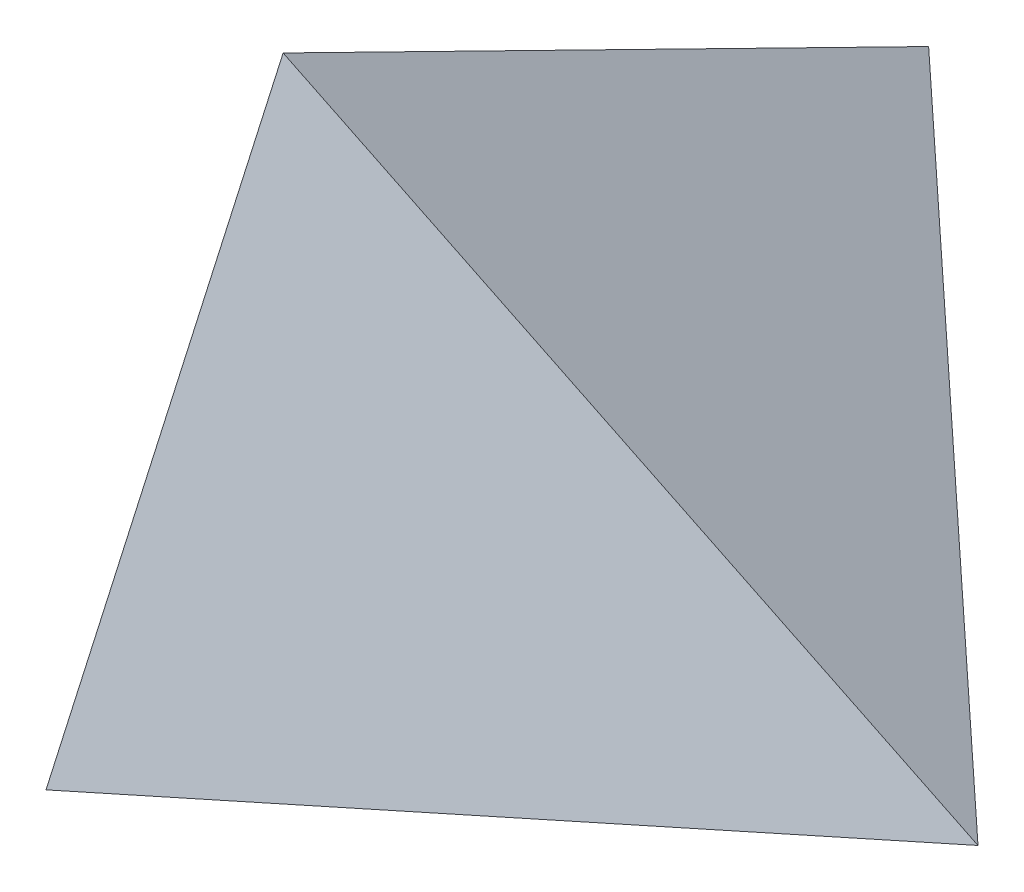
ISO-10303-21;
HEADER;
FILE_DESCRIPTION(('STEP AP214'),'2;1');
FILE_NAME('part.step','',(''),(''),'','','');
FILE_SCHEMA(('AUTOMOTIVE_DESIGN { 1 0 10303 214 1 1 1 1 }'));
ENDSEC;
DATA;
#1=APPLICATION_CONTEXT('core data for automotive mechanical design processes');
#2=APPLICATION_PROTOCOL_DEFINITION('international standard','automotive_design',2000,#1);
#3=PRODUCT_CONTEXT('',#1,'mechanical');
#4=PRODUCT('Part','Part','',(#3));
#5=PRODUCT_RELATED_PRODUCT_CATEGORY('part','',(#4));
#6=PRODUCT_DEFINITION_FORMATION('','',#4);
#7=PRODUCT_DEFINITION_CONTEXT('part definition',#1,'design');
#8=PRODUCT_DEFINITION('design','',#6,#7);
#9=PRODUCT_DEFINITION_SHAPE('','',#8);
#10=(LENGTH_UNIT() NAMED_UNIT(*) SI_UNIT(.MILLI.,.METRE.));
#11=(NAMED_UNIT(*) PLANE_ANGLE_UNIT() SI_UNIT($,.RADIAN.));
#12=(NAMED_UNIT(*) SI_UNIT($,.STERADIAN.) SOLID_ANGLE_UNIT());
#13=UNCERTAINTY_MEASURE_WITH_UNIT(LENGTH_MEASURE(1.E-05),#10,'distance_accuracy_value','');
#14=(GEOMETRIC_REPRESENTATION_CONTEXT(3) GLOBAL_UNCERTAINTY_ASSIGNED_CONTEXT((#13)) GLOBAL_UNIT_ASSIGNED_CONTEXT((#10,
#11,#12)) REPRESENTATION_CONTEXT('',''));
#15=CARTESIAN_POINT('',(0.,0.,0.));
#16=DIRECTION('',(0.,0.,1.));
#17=DIRECTION('',(1.,0.,0.));
#18=AXIS2_PLACEMENT_3D('',#15,#16,#17);
#19=CARTESIAN_POINT('',(0.,5.,0.));
#20=DIRECTION('',(0.389152688830815,-0.868020634220767,-0.308383468011376));
#21=DIRECTION('',(0.912493631813819,0.409090909088953,0.));
#22=AXIS2_PLACEMENT_3D('',#19,#20,#21);
#23=PLANE('',#22);
#24=DIRECTION('',(-0.912493631813819,-0.409090909088953,0.));
#25=VECTOR('',#24,1.);
#26=CARTESIAN_POINT('',(100.3742995,50.,0.));
#27=LINE('',#26,#25);
#28=CARTESIAN_POINT('',(100.3742995,50.,0.));
#29=VERTEX_POINT('',#28);
#30=CARTESIAN_POINT('',(0.,5.,0.));
#31=VERTEX_POINT('',#30);
#32=EDGE_CURVE('E68',#29,#31,#27,.T.);
#33=ORIENTED_EDGE('',*,*,#32,.T.);
#34=DIRECTION('',(0.146673225113615,0.388888888895528,-0.909534164904416));
#35=VECTOR('',#34,1.);
#36=CARTESIAN_POINT('',(0.,5.,0.));
#37=LINE('',#36,#35);
#38=CARTESIAN_POINT('',(13.20059026,40.,-81.85807484));
#39=VERTEX_POINT('',#38);
#40=EDGE_CURVE('E43',#31,#39,#37,.T.);
#41=ORIENTED_EDGE('',*,*,#40,.T.);
#42=DIRECTION('',(0.726447577020908,0.0833333333357317,0.6821506236863));
#43=VECTOR('',#42,1.);
#44=CARTESIAN_POINT('',(13.20059026,40.,-81.85807484));
#45=LINE('',#44,#43);
#46=EDGE_CURVE('E12',#39,#29,#45,.T.);
#47=ORIENTED_EDGE('',*,*,#46,.T.);
#48=EDGE_LOOP('',(#33,#41,#47));
#49=FACE_BOUND('',#48,.T.);
#50=ADVANCED_FACE('F33',(#49),#23,.T.);
#51=CARTESIAN_POINT('',(13.20059026,74.16032351,-12.33876216));
#52=DIRECTION('',(0.981415860695536,-0.172224075898904,0.084627277257445));
#53=DIRECTION('',(0.172844123506839,0.984949191059698,0.));
#54=AXIS2_PLACEMENT_3D('',#51,#52,#53);
#55=PLANE('',#54);
#56=DIRECTION('',(0.184670588314493,0.967523222754159,-0.172613983335606));
#57=VECTOR('',#56,1.);
#58=CARTESIAN_POINT('',(0.,5.,0.));
#59=LINE('',#58,#57);
#60=CARTESIAN_POINT('',(13.20059026,74.16032351,-12.33876216));
#61=VERTEX_POINT('',#60);
#62=EDGE_CURVE('E65',#31,#61,#59,.T.);
#63=ORIENTED_EDGE('',*,*,#62,.T.);
#64=DIRECTION('',(0.,0.441012932096943,0.897500748592032));
#65=VECTOR('',#64,1.);
#66=CARTESIAN_POINT('',(13.20059026,40.,-81.85807484));
#67=LINE('',#66,#65);
#68=EDGE_CURVE('E58',#39,#61,#67,.T.);
#69=ORIENTED_EDGE('',*,*,#68,.F.);
#70=ORIENTED_EDGE('',*,*,#40,.F.);
#71=EDGE_LOOP('',(#63,#69,#70));
#72=FACE_BOUND('',#71,.T.);
#73=ADVANCED_FACE('F64',(#72),#55,.F.);
#74=CARTESIAN_POINT('',(13.20059026,74.16032351,-12.33876216));
#75=DIRECTION('',(-0.297114014847471,-0.856971417878747,0.421097674085368));
#76=DIRECTION('',(0.,-0.441012932096943,-0.897500748592032));
#77=AXIS2_PLACEMENT_3D('',#74,#75,#76);
#78=PLANE('',#77);
#79=ORIENTED_EDGE('',*,*,#68,.T.);
#80=DIRECTION('',(-0.954831951668685,0.264633099258036,-0.135149054194456));
#81=VECTOR('',#80,1.);
#82=CARTESIAN_POINT('',(100.3742995,50.,0.));
#83=LINE('',#82,#81);
#84=EDGE_CURVE('E76',#29,#61,#83,.T.);
#85=ORIENTED_EDGE('',*,*,#84,.F.);
#86=ORIENTED_EDGE('',*,*,#46,.F.);
#87=EDGE_LOOP('',(#79,#85,#86));
#88=FACE_BOUND('',#87,.T.);
#89=ADVANCED_FACE('F109',(#88),#78,.F.);
#90=CARTESIAN_POINT('',(13.20059026,74.16032351,-12.33876216));
#91=DIRECTION('',(0.0855357450763093,-0.190790899872114,-0.977896962281932));
#92=DIRECTION('',(0.,0.981494037404415,-0.191492701008631));
#93=AXIS2_PLACEMENT_3D('',#90,#91,#92);
#94=PLANE('',#93);
#95=ORIENTED_EDGE('',*,*,#84,.T.);
#96=ORIENTED_EDGE('',*,*,#62,.F.);
#97=ORIENTED_EDGE('',*,*,#32,.F.);
#98=EDGE_LOOP('',(#95,#96,#97));
#99=FACE_BOUND('',#98,.T.);
#100=ADVANCED_FACE('F73',(#99),#94,.F.);
#101=CLOSED_SHELL('',(#50,#73,#89,#100));
#102=MANIFOLD_SOLID_BREP('B2',#101);
#103=ADVANCED_BREP_SHAPE_REPRESENTATION('',(#18,#102),#14);
#104=SHAPE_DEFINITION_REPRESENTATION(#9,#103);
ENDSEC;
END-ISO-10303-21;
